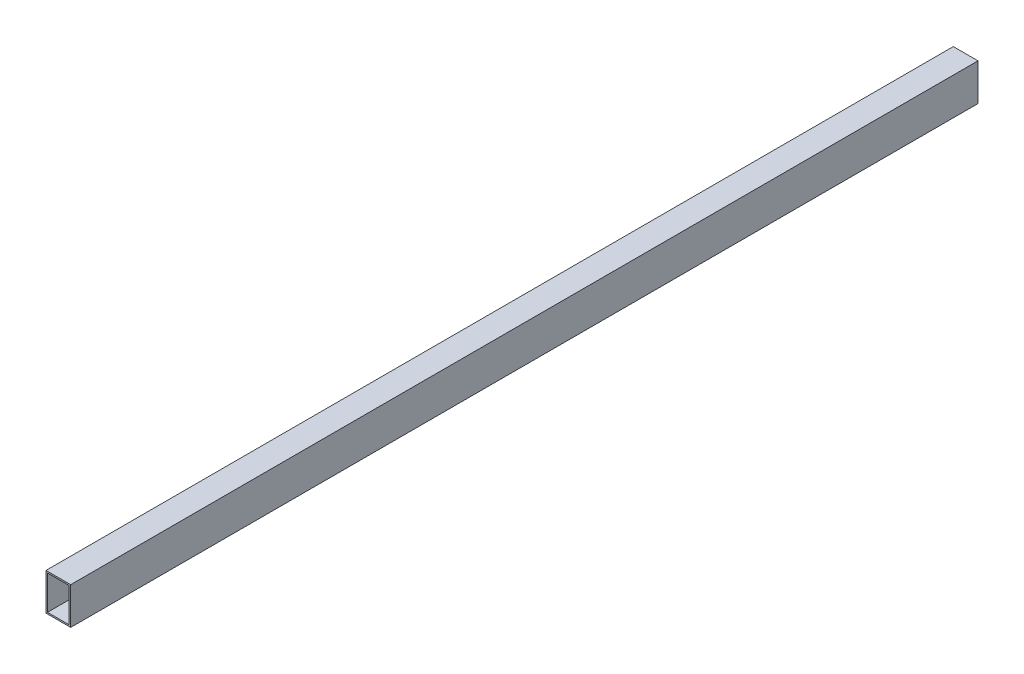
ISO-10303-21;
HEADER;
FILE_DESCRIPTION(('STEP AP214'),'2;1');
FILE_NAME('part.step','',(''),(''),'','','');
FILE_SCHEMA(('AUTOMOTIVE_DESIGN { 1 0 10303 214 1 1 1 1 }'));
ENDSEC;
DATA;
#1=APPLICATION_CONTEXT('core data for automotive mechanical design processes');
#2=APPLICATION_PROTOCOL_DEFINITION('international standard','automotive_design',2000,#1);
#3=PRODUCT_CONTEXT('',#1,'mechanical');
#4=PRODUCT('Part','Part','',(#3));
#5=PRODUCT_RELATED_PRODUCT_CATEGORY('part','',(#4));
#6=PRODUCT_DEFINITION_FORMATION('','',#4);
#7=PRODUCT_DEFINITION_CONTEXT('part definition',#1,'design');
#8=PRODUCT_DEFINITION('design','',#6,#7);
#9=PRODUCT_DEFINITION_SHAPE('','',#8);
#10=(LENGTH_UNIT() NAMED_UNIT(*) SI_UNIT(.MILLI.,.METRE.));
#11=(NAMED_UNIT(*) PLANE_ANGLE_UNIT() SI_UNIT($,.RADIAN.));
#12=(NAMED_UNIT(*) SI_UNIT($,.STERADIAN.) SOLID_ANGLE_UNIT());
#13=UNCERTAINTY_MEASURE_WITH_UNIT(LENGTH_MEASURE(1.E-05),#10,'distance_accuracy_value','');
#14=(GEOMETRIC_REPRESENTATION_CONTEXT(3) GLOBAL_UNCERTAINTY_ASSIGNED_CONTEXT((#13)) GLOBAL_UNIT_ASSIGNED_CONTEXT((#10,
#11,#12)) REPRESENTATION_CONTEXT('',''));
#15=CARTESIAN_POINT('',(0.,0.,0.));
#16=DIRECTION('',(0.,0.,1.));
#17=DIRECTION('',(1.,0.,0.));
#18=AXIS2_PLACEMENT_3D('',#15,#16,#17);
#19=CARTESIAN_POINT('',(0.,0.,3675.));
#20=DIRECTION('',(0.,0.,1.));
#21=DIRECTION('',(1.,0.,0.));
#22=AXIS2_PLACEMENT_3D('',#19,#20,#21);
#23=PLANE('',#22);
#24=DIRECTION('',(0.,-1.,0.));
#25=VECTOR('',#24,1.);
#26=CARTESIAN_POINT('',(-50.,75.,3675.));
#27=LINE('',#26,#25);
#28=CARTESIAN_POINT('',(-50.,75.,3675.));
#29=VERTEX_POINT('',#28);
#30=CARTESIAN_POINT('',(-50.,-75.,3675.));
#31=VERTEX_POINT('',#30);
#32=EDGE_CURVE('E159',#29,#31,#27,.T.);
#33=ORIENTED_EDGE('',*,*,#32,.T.);
#34=DIRECTION('',(1.,0.,0.));
#35=VECTOR('',#34,1.);
#36=CARTESIAN_POINT('',(-50.,-75.,3675.));
#37=LINE('',#36,#35);
#38=CARTESIAN_POINT('',(50.,-75.,3675.));
#39=VERTEX_POINT('',#38);
#40=EDGE_CURVE('E163',#31,#39,#37,.T.);
#41=ORIENTED_EDGE('',*,*,#40,.T.);
#42=DIRECTION('',(0.,1.,0.));
#43=VECTOR('',#42,1.);
#44=CARTESIAN_POINT('',(50.,75.,3675.));
#45=LINE('',#44,#43);
#46=CARTESIAN_POINT('',(50.,75.,3675.));
#47=VERTEX_POINT('',#46);
#48=EDGE_CURVE('E167',#39,#47,#45,.T.);
#49=ORIENTED_EDGE('',*,*,#48,.T.);
#50=DIRECTION('',(-1.,0.,0.));
#51=VECTOR('',#50,1.);
#52=CARTESIAN_POINT('',(-50.,75.,3675.));
#53=LINE('',#52,#51);
#54=EDGE_CURVE('E170',#47,#29,#53,.T.);
#55=ORIENTED_EDGE('',*,*,#54,.T.);
#56=EDGE_LOOP('',(#33,#41,#49,#55));
#57=FACE_BOUND('',#56,.T.);
#58=DIRECTION('',(1.,0.,0.));
#59=VECTOR('',#58,1.);
#60=CARTESIAN_POINT('',(-44.,-69.,3675.));
#61=LINE('',#60,#59);
#62=CARTESIAN_POINT('',(-44.,-69.,3675.));
#63=VERTEX_POINT('',#62);
#64=CARTESIAN_POINT('',(44.,-69.,3675.));
#65=VERTEX_POINT('',#64);
#66=EDGE_CURVE('E120',#63,#65,#61,.T.);
#67=ORIENTED_EDGE('',*,*,#66,.F.);
#68=DIRECTION('',(0.,-1.,0.));
#69=VECTOR('',#68,1.);
#70=CARTESIAN_POINT('',(-44.,69.,3675.));
#71=LINE('',#70,#69);
#72=CARTESIAN_POINT('',(-44.,69.,3675.));
#73=VERTEX_POINT('',#72);
#74=EDGE_CURVE('E111',#73,#63,#71,.T.);
#75=ORIENTED_EDGE('',*,*,#74,.F.);
#76=DIRECTION('',(-1.,0.,0.));
#77=VECTOR('',#76,1.);
#78=CARTESIAN_POINT('',(-44.,69.,3675.));
#79=LINE('',#78,#77);
#80=CARTESIAN_POINT('',(44.,69.,3675.));
#81=VERTEX_POINT('',#80);
#82=EDGE_CURVE('E137',#81,#73,#79,.T.);
#83=ORIENTED_EDGE('',*,*,#82,.F.);
#84=DIRECTION('',(0.,1.,0.));
#85=VECTOR('',#84,1.);
#86=CARTESIAN_POINT('',(44.,69.,3675.));
#87=LINE('',#86,#85);
#88=EDGE_CURVE('E133',#65,#81,#87,.T.);
#89=ORIENTED_EDGE('',*,*,#88,.F.);
#90=EDGE_LOOP('',(#67,#75,#83,#89));
#91=FACE_BOUND('',#90,.T.);
#92=ADVANCED_FACE('F45',(#57,#91),#23,.T.);
#93=CARTESIAN_POINT('',(0.,0.,0.));
#94=DIRECTION('',(0.,0.,1.));
#95=DIRECTION('',(1.,0.,0.));
#96=AXIS2_PLACEMENT_3D('',#93,#94,#95);
#97=PLANE('',#96);
#98=DIRECTION('',(0.,-1.,0.));
#99=VECTOR('',#98,1.);
#100=CARTESIAN_POINT('',(-50.,75.,0.));
#101=LINE('',#100,#99);
#102=CARTESIAN_POINT('',(-50.,75.,0.));
#103=VERTEX_POINT('',#102);
#104=CARTESIAN_POINT('',(-50.,-75.,0.));
#105=VERTEX_POINT('',#104);
#106=EDGE_CURVE('E129',#103,#105,#101,.T.);
#107=ORIENTED_EDGE('',*,*,#106,.F.);
#108=DIRECTION('',(-1.,0.,0.));
#109=VECTOR('',#108,1.);
#110=CARTESIAN_POINT('',(-50.,75.,0.));
#111=LINE('',#110,#109);
#112=CARTESIAN_POINT('',(50.,75.,0.));
#113=VERTEX_POINT('',#112);
#114=EDGE_CURVE('E164',#113,#103,#111,.T.);
#115=ORIENTED_EDGE('',*,*,#114,.F.);
#116=DIRECTION('',(0.,1.,0.));
#117=VECTOR('',#116,1.);
#118=CARTESIAN_POINT('',(50.,75.,0.));
#119=LINE('',#118,#117);
#120=CARTESIAN_POINT('',(50.,-75.,0.));
#121=VERTEX_POINT('',#120);
#122=EDGE_CURVE('E180',#121,#113,#119,.T.);
#123=ORIENTED_EDGE('',*,*,#122,.F.);
#124=DIRECTION('',(1.,0.,0.));
#125=VECTOR('',#124,1.);
#126=CARTESIAN_POINT('',(-50.,-75.,0.));
#127=LINE('',#126,#125);
#128=EDGE_CURVE('E177',#105,#121,#127,.T.);
#129=ORIENTED_EDGE('',*,*,#128,.F.);
#130=EDGE_LOOP('',(#107,#115,#123,#129));
#131=FACE_BOUND('',#130,.T.);
#132=DIRECTION('',(0.,-1.,0.));
#133=VECTOR('',#132,1.);
#134=CARTESIAN_POINT('',(-44.,69.,0.));
#135=LINE('',#134,#133);
#136=CARTESIAN_POINT('',(-44.,69.,0.));
#137=VERTEX_POINT('',#136);
#138=CARTESIAN_POINT('',(-44.,-69.,0.));
#139=VERTEX_POINT('',#138);
#140=EDGE_CURVE('E69',#137,#139,#135,.T.);
#141=ORIENTED_EDGE('',*,*,#140,.T.);
#142=DIRECTION('',(1.,0.,0.));
#143=VECTOR('',#142,1.);
#144=CARTESIAN_POINT('',(-44.,-69.,0.));
#145=LINE('',#144,#143);
#146=CARTESIAN_POINT('',(44.,-69.,0.));
#147=VERTEX_POINT('',#146);
#148=EDGE_CURVE('E127',#139,#147,#145,.T.);
#149=ORIENTED_EDGE('',*,*,#148,.T.);
#150=DIRECTION('',(0.,1.,0.));
#151=VECTOR('',#150,1.);
#152=CARTESIAN_POINT('',(44.,69.,0.));
#153=LINE('',#152,#151);
#154=CARTESIAN_POINT('',(44.,69.,0.));
#155=VERTEX_POINT('',#154);
#156=EDGE_CURVE('E146',#147,#155,#153,.T.);
#157=ORIENTED_EDGE('',*,*,#156,.T.);
#158=DIRECTION('',(-1.,0.,0.));
#159=VECTOR('',#158,1.);
#160=CARTESIAN_POINT('',(-44.,69.,0.));
#161=LINE('',#160,#159);
#162=EDGE_CURVE('E121',#155,#137,#161,.T.);
#163=ORIENTED_EDGE('',*,*,#162,.T.);
#164=EDGE_LOOP('',(#141,#149,#157,#163));
#165=FACE_BOUND('',#164,.T.);
#166=ADVANCED_FACE('F203',(#131,#165),#97,.F.);
#167=CARTESIAN_POINT('',(-50.,75.,3675.));
#168=DIRECTION('',(1.,0.,0.));
#169=DIRECTION('',(0.,1.,0.));
#170=AXIS2_PLACEMENT_3D('',#167,#168,#169);
#171=PLANE('',#170);
#172=ORIENTED_EDGE('',*,*,#106,.T.);
#173=DIRECTION('',(0.,0.,-1.));
#174=VECTOR('',#173,1.);
#175=CARTESIAN_POINT('',(-50.,-75.,3675.));
#176=LINE('',#175,#174);
#177=EDGE_CURVE('E11',#31,#105,#176,.T.);
#178=ORIENTED_EDGE('',*,*,#177,.F.);
#179=ORIENTED_EDGE('',*,*,#32,.F.);
#180=DIRECTION('',(0.,0.,-1.));
#181=VECTOR('',#180,1.);
#182=CARTESIAN_POINT('',(-50.,75.,3675.));
#183=LINE('',#182,#181);
#184=EDGE_CURVE('E173',#29,#103,#183,.T.);
#185=ORIENTED_EDGE('',*,*,#184,.T.);
#186=EDGE_LOOP('',(#172,#178,#179,#185));
#187=FACE_BOUND('',#186,.T.);
#188=ADVANCED_FACE('F47',(#187),#171,.F.);
#189=CARTESIAN_POINT('',(-50.,-75.,3675.));
#190=DIRECTION('',(0.,1.,0.));
#191=DIRECTION('',(0.,0.,1.));
#192=AXIS2_PLACEMENT_3D('',#189,#190,#191);
#193=PLANE('',#192);
#194=ORIENTED_EDGE('',*,*,#128,.T.);
#195=DIRECTION('',(0.,0.,-1.));
#196=VECTOR('',#195,1.);
#197=CARTESIAN_POINT('',(50.,-75.,3675.));
#198=LINE('',#197,#196);
#199=EDGE_CURVE('E54',#39,#121,#198,.T.);
#200=ORIENTED_EDGE('',*,*,#199,.F.);
#201=ORIENTED_EDGE('',*,*,#40,.F.);
#202=ORIENTED_EDGE('',*,*,#177,.T.);
#203=EDGE_LOOP('',(#194,#200,#201,#202));
#204=FACE_BOUND('',#203,.T.);
#205=ADVANCED_FACE('F213',(#204),#193,.F.);
#206=CARTESIAN_POINT('',(50.,75.,3675.));
#207=DIRECTION('',(-1.,0.,0.));
#208=DIRECTION('',(0.,-1.,0.));
#209=AXIS2_PLACEMENT_3D('',#206,#207,#208);
#210=PLANE('',#209);
#211=ORIENTED_EDGE('',*,*,#122,.T.);
#212=DIRECTION('',(0.,0.,-1.));
#213=VECTOR('',#212,1.);
#214=CARTESIAN_POINT('',(50.,75.,3675.));
#215=LINE('',#214,#213);
#216=EDGE_CURVE('E188',#47,#113,#215,.T.);
#217=ORIENTED_EDGE('',*,*,#216,.F.);
#218=ORIENTED_EDGE('',*,*,#48,.F.);
#219=ORIENTED_EDGE('',*,*,#199,.T.);
#220=EDGE_LOOP('',(#211,#217,#218,#219));
#221=FACE_BOUND('',#220,.T.);
#222=ADVANCED_FACE('F197',(#221),#210,.F.);
#223=CARTESIAN_POINT('',(-50.,75.,3675.));
#224=DIRECTION('',(0.,-1.,0.));
#225=DIRECTION('',(0.,0.,-1.));
#226=AXIS2_PLACEMENT_3D('',#223,#224,#225);
#227=PLANE('',#226);
#228=ORIENTED_EDGE('',*,*,#114,.T.);
#229=ORIENTED_EDGE('',*,*,#184,.F.);
#230=ORIENTED_EDGE('',*,*,#54,.F.);
#231=ORIENTED_EDGE('',*,*,#216,.T.);
#232=EDGE_LOOP('',(#228,#229,#230,#231));
#233=FACE_BOUND('',#232,.T.);
#234=ADVANCED_FACE('F207',(#233),#227,.F.);
#235=CARTESIAN_POINT('',(-44.,69.,3675.));
#236=DIRECTION('',(1.,0.,0.));
#237=DIRECTION('',(0.,1.,0.));
#238=AXIS2_PLACEMENT_3D('',#235,#236,#237);
#239=PLANE('',#238);
#240=ORIENTED_EDGE('',*,*,#140,.F.);
#241=DIRECTION('',(0.,0.,-1.));
#242=VECTOR('',#241,1.);
#243=CARTESIAN_POINT('',(-44.,69.,3675.));
#244=LINE('',#243,#242);
#245=EDGE_CURVE('E115',#73,#137,#244,.T.);
#246=ORIENTED_EDGE('',*,*,#245,.F.);
#247=ORIENTED_EDGE('',*,*,#74,.T.);
#248=DIRECTION('',(0.,0.,-1.));
#249=VECTOR('',#248,1.);
#250=CARTESIAN_POINT('',(-44.,-69.,3675.));
#251=LINE('',#250,#249);
#252=EDGE_CURVE('E114',#63,#139,#251,.T.);
#253=ORIENTED_EDGE('',*,*,#252,.T.);
#254=EDGE_LOOP('',(#240,#246,#247,#253));
#255=FACE_BOUND('',#254,.T.);
#256=ADVANCED_FACE('F113',(#255),#239,.T.);
#257=CARTESIAN_POINT('',(-44.,-69.,3675.));
#258=DIRECTION('',(0.,1.,0.));
#259=DIRECTION('',(0.,0.,1.));
#260=AXIS2_PLACEMENT_3D('',#257,#258,#259);
#261=PLANE('',#260);
#262=ORIENTED_EDGE('',*,*,#148,.F.);
#263=ORIENTED_EDGE('',*,*,#252,.F.);
#264=ORIENTED_EDGE('',*,*,#66,.T.);
#265=DIRECTION('',(0.,0.,-1.));
#266=VECTOR('',#265,1.);
#267=CARTESIAN_POINT('',(44.,-69.,3675.));
#268=LINE('',#267,#266);
#269=EDGE_CURVE('E130',#65,#147,#268,.T.);
#270=ORIENTED_EDGE('',*,*,#269,.T.);
#271=EDGE_LOOP('',(#262,#263,#264,#270));
#272=FACE_BOUND('',#271,.T.);
#273=ADVANCED_FACE('F124',(#272),#261,.T.);
#274=CARTESIAN_POINT('',(44.,69.,3675.));
#275=DIRECTION('',(-1.,0.,0.));
#276=DIRECTION('',(0.,-1.,0.));
#277=AXIS2_PLACEMENT_3D('',#274,#275,#276);
#278=PLANE('',#277);
#279=ORIENTED_EDGE('',*,*,#156,.F.);
#280=ORIENTED_EDGE('',*,*,#269,.F.);
#281=ORIENTED_EDGE('',*,*,#88,.T.);
#282=DIRECTION('',(0.,0.,-1.));
#283=VECTOR('',#282,1.);
#284=CARTESIAN_POINT('',(44.,69.,3675.));
#285=LINE('',#284,#283);
#286=EDGE_CURVE('E61',#81,#155,#285,.T.);
#287=ORIENTED_EDGE('',*,*,#286,.T.);
#288=EDGE_LOOP('',(#279,#280,#281,#287));
#289=FACE_BOUND('',#288,.T.);
#290=ADVANCED_FACE('F236',(#289),#278,.T.);
#291=CARTESIAN_POINT('',(-44.,69.,3675.));
#292=DIRECTION('',(0.,-1.,0.));
#293=DIRECTION('',(0.,0.,-1.));
#294=AXIS2_PLACEMENT_3D('',#291,#292,#293);
#295=PLANE('',#294);
#296=ORIENTED_EDGE('',*,*,#162,.F.);
#297=ORIENTED_EDGE('',*,*,#286,.F.);
#298=ORIENTED_EDGE('',*,*,#82,.T.);
#299=ORIENTED_EDGE('',*,*,#245,.T.);
#300=EDGE_LOOP('',(#296,#297,#298,#299));
#301=FACE_BOUND('',#300,.T.);
#302=ADVANCED_FACE('F240',(#301),#295,.T.);
#303=CLOSED_SHELL('',(#92,#166,#188,#205,#222,#234,#256,#273,#290,#302));
#304=MANIFOLD_SOLID_BREP('B2',#303);
#305=ADVANCED_BREP_SHAPE_REPRESENTATION('',(#18,#304),#14);
#306=SHAPE_DEFINITION_REPRESENTATION(#9,#305);
ENDSEC;
END-ISO-10303-21;
